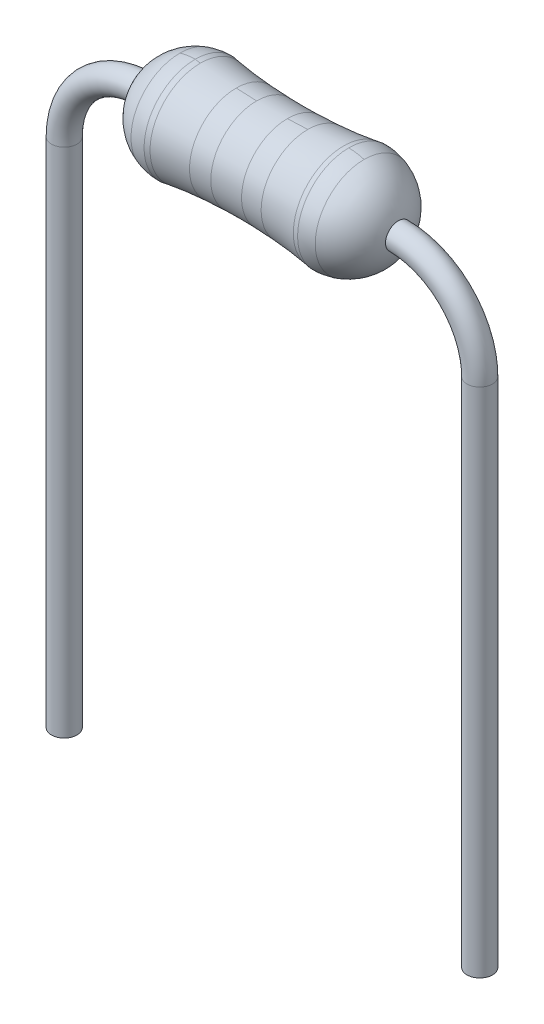
ISO-10303-21;
HEADER;
FILE_DESCRIPTION(('STEP AP214'),'2;1');
FILE_NAME('part.step','',(''),(''),'','','');
FILE_SCHEMA(('AUTOMOTIVE_DESIGN { 1 0 10303 214 1 1 1 1 }'));
ENDSEC;
DATA;
#1=APPLICATION_CONTEXT('core data for automotive mechanical design processes');
#2=APPLICATION_PROTOCOL_DEFINITION('international standard','automotive_design',2000,#1);
#3=PRODUCT_CONTEXT('',#1,'mechanical');
#4=PRODUCT('Part','Part','',(#3));
#5=PRODUCT_RELATED_PRODUCT_CATEGORY('part','',(#4));
#6=PRODUCT_DEFINITION_FORMATION('','',#4);
#7=PRODUCT_DEFINITION_CONTEXT('part definition',#1,'design');
#8=PRODUCT_DEFINITION('design','',#6,#7);
#9=PRODUCT_DEFINITION_SHAPE('','',#8);
#10=(LENGTH_UNIT() NAMED_UNIT(*) SI_UNIT(.MILLI.,.METRE.));
#11=(NAMED_UNIT(*) PLANE_ANGLE_UNIT() SI_UNIT($,.RADIAN.));
#12=(NAMED_UNIT(*) SI_UNIT($,.STERADIAN.) SOLID_ANGLE_UNIT());
#13=UNCERTAINTY_MEASURE_WITH_UNIT(LENGTH_MEASURE(1.E-05),#10,'distance_accuracy_value','');
#14=(GEOMETRIC_REPRESENTATION_CONTEXT(3) GLOBAL_UNCERTAINTY_ASSIGNED_CONTEXT((#13)) GLOBAL_UNIT_ASSIGNED_CONTEXT((#10,
#11,#12)) REPRESENTATION_CONTEXT('',''));
#15=CARTESIAN_POINT('',(0.,0.,0.));
#16=DIRECTION('',(0.,0.,1.));
#17=DIRECTION('',(1.,0.,0.));
#18=AXIS2_PLACEMENT_3D('',#15,#16,#17);
#19=CARTESIAN_POINT('',(-3.13467221242086,-2.02126777726707,0.));
#20=DIRECTION('',(0.,0.,-1.));
#21=DIRECTION('',(0.,1.,0.));
#22=AXIS2_PLACEMENT_3D('',#19,#20,#21);
#23=TOROIDAL_SURFACE('',#22,2.02126777726707,0.3175);
#24=CARTESIAN_POINT('',(-3.13467221242085,0.,0.));
#25=DIRECTION('',(-1.,0.,0.));
#26=DIRECTION('',(0.,0.,1.));
#27=AXIS2_PLACEMENT_3D('',#24,#25,#26);
#28=CIRCLE('',#27,0.3175);
#29=CARTESIAN_POINT('',(-3.13467221242085,0.,0.3175));
#30=VERTEX_POINT('',#29);
#31=EDGE_CURVE('E108',#30,#30,#28,.T.);
#32=ORIENTED_EDGE('',*,*,#31,.T.);
#33=EDGE_LOOP('',(#32));
#34=FACE_BOUND('',#33,.T.);
#35=CARTESIAN_POINT('',(-5.15593998968792,-2.02126777726707,0.));
#36=DIRECTION('',(0.,-1.,0.));
#37=DIRECTION('',(0.,0.,-1.));
#38=AXIS2_PLACEMENT_3D('',#35,#36,#37);
#39=CIRCLE('',#38,0.3175);
#40=CARTESIAN_POINT('',(-5.15593998968792,-2.02126777726707,-0.3175));
#41=VERTEX_POINT('',#40);
#42=EDGE_CURVE('E13',#41,#41,#39,.T.);
#43=ORIENTED_EDGE('',*,*,#42,.F.);
#44=EDGE_LOOP('',(#43));
#45=FACE_BOUND('',#44,.T.);
#46=ADVANCED_FACE('F100',(#34,#45),#23,.T.);
#47=CARTESIAN_POINT('',(-5.15593998968789,-14.7212677772671,0.));
#48=DIRECTION('',(0.,1.,0.));
#49=DIRECTION('',(0.,0.,1.));
#50=AXIS2_PLACEMENT_3D('',#47,#48,#49);
#51=CYLINDRICAL_SURFACE('',#50,0.3175);
#52=ORIENTED_EDGE('',*,*,#42,.T.);
#53=EDGE_LOOP('',(#52));
#54=FACE_BOUND('',#53,.T.);
#55=CARTESIAN_POINT('',(-5.15593998968789,-14.7212677772671,0.));
#56=DIRECTION('',(0.,-1.,0.));
#57=DIRECTION('',(0.,0.,1.));
#58=AXIS2_PLACEMENT_3D('',#55,#56,#57);
#59=CIRCLE('',#58,0.3175);
#60=CARTESIAN_POINT('',(-5.15593998968789,-14.7212677772671,0.3175));
#61=VERTEX_POINT('',#60);
#62=EDGE_CURVE('E113',#61,#61,#59,.T.);
#63=ORIENTED_EDGE('',*,*,#62,.F.);
#64=EDGE_LOOP('',(#63));
#65=FACE_BOUND('',#64,.T.);
#66=ADVANCED_FACE('F124',(#54,#65),#51,.T.);
#67=CARTESIAN_POINT('',(-5.15593998968789,-14.7212677772671,0.));
#68=DIRECTION('',(0.,1.,0.));
#69=DIRECTION('',(0.,0.,1.));
#70=AXIS2_PLACEMENT_3D('',#67,#68,#69);
#71=PLANE('',#70);
#72=ORIENTED_EDGE('',*,*,#62,.T.);
#73=EDGE_LOOP('',(#72));
#74=FACE_BOUND('',#73,.T.);
#75=ADVANCED_FACE('F122',(#74),#71,.F.);
#76=CARTESIAN_POINT('',(-3.13467221242085,0.,0.));
#77=DIRECTION('',(1.,0.,0.));
#78=DIRECTION('',(0.,0.,1.));
#79=AXIS2_PLACEMENT_3D('',#76,#77,#78);
#80=PLANE('',#79);
#81=ORIENTED_EDGE('',*,*,#31,.F.);
#82=EDGE_LOOP('',(#81));
#83=FACE_BOUND('',#82,.T.);
#84=ADVANCED_FACE('F102',(#83),#80,.T.);
#85=CLOSED_SHELL('',(#46,#66,#75,#84));
#86=MANIFOLD_SOLID_BREP('B2',#85);
#87=CARTESIAN_POINT('',(5.15593998968788,-14.7212677772671,0.));
#88=DIRECTION('',(0.,1.,0.));
#89=DIRECTION('',(0.,0.,1.));
#90=AXIS2_PLACEMENT_3D('',#87,#88,#89);
#91=CYLINDRICAL_SURFACE('',#90,0.3175);
#92=CARTESIAN_POINT('',(5.15593998968792,-2.02126777726707,0.));
#93=DIRECTION('',(0.,1.,0.));
#94=DIRECTION('',(0.,0.,-1.));
#95=AXIS2_PLACEMENT_3D('',#92,#93,#94);
#96=CIRCLE('',#95,0.3175);
#97=CARTESIAN_POINT('',(5.15593998968792,-2.02126777726707,-0.3175));
#98=VERTEX_POINT('',#97);
#99=EDGE_CURVE('E179',#98,#98,#96,.T.);
#100=ORIENTED_EDGE('',*,*,#99,.F.);
#101=EDGE_LOOP('',(#100));
#102=FACE_BOUND('',#101,.T.);
#103=CARTESIAN_POINT('',(5.15593998968788,-14.7212677772671,0.));
#104=DIRECTION('',(0.,1.,0.));
#105=DIRECTION('',(0.,0.,1.));
#106=AXIS2_PLACEMENT_3D('',#103,#104,#105);
#107=CIRCLE('',#106,0.3175);
#108=CARTESIAN_POINT('',(5.15593998968788,-14.7212677772671,0.3175));
#109=VERTEX_POINT('',#108);
#110=EDGE_CURVE('E99',#109,#109,#107,.T.);
#111=ORIENTED_EDGE('',*,*,#110,.T.);
#112=EDGE_LOOP('',(#111));
#113=FACE_BOUND('',#112,.T.);
#114=ADVANCED_FACE('F171',(#102,#113),#91,.T.);
#115=CARTESIAN_POINT('',(3.13467221242085,-2.02126777726707,0.));
#116=DIRECTION('',(0.,0.,-1.));
#117=DIRECTION('',(0.,1.,0.));
#118=AXIS2_PLACEMENT_3D('',#115,#116,#117);
#119=TOROIDAL_SURFACE('',#118,2.02126777726707,0.3175);
#120=CARTESIAN_POINT('',(3.13467221242085,0.,0.));
#121=DIRECTION('',(-1.,0.,0.));
#122=DIRECTION('',(0.,0.,1.));
#123=AXIS2_PLACEMENT_3D('',#120,#121,#122);
#124=CIRCLE('',#123,0.3175);
#125=CARTESIAN_POINT('',(3.13467221242085,0.,0.3175));
#126=VERTEX_POINT('',#125);
#127=EDGE_CURVE('E184',#126,#126,#124,.T.);
#128=ORIENTED_EDGE('',*,*,#127,.F.);
#129=EDGE_LOOP('',(#128));
#130=FACE_BOUND('',#129,.T.);
#131=ORIENTED_EDGE('',*,*,#99,.T.);
#132=EDGE_LOOP('',(#131));
#133=FACE_BOUND('',#132,.T.);
#134=ADVANCED_FACE('F194',(#130,#133),#119,.T.);
#135=CARTESIAN_POINT('',(5.15593998968788,-14.7212677772671,0.));
#136=DIRECTION('',(0.,1.,0.));
#137=DIRECTION('',(0.,0.,1.));
#138=AXIS2_PLACEMENT_3D('',#135,#136,#137);
#139=PLANE('',#138);
#140=ORIENTED_EDGE('',*,*,#110,.F.);
#141=EDGE_LOOP('',(#140));
#142=FACE_BOUND('',#141,.T.);
#143=ADVANCED_FACE('F197',(#142),#139,.F.);
#144=CARTESIAN_POINT('',(3.13467221242085,0.,0.));
#145=DIRECTION('',(-1.,0.,0.));
#146=DIRECTION('',(0.,0.,1.));
#147=AXIS2_PLACEMENT_3D('',#144,#145,#146);
#148=PLANE('',#147);
#149=ORIENTED_EDGE('',*,*,#127,.T.);
#150=EDGE_LOOP('',(#149));
#151=FACE_BOUND('',#150,.T.);
#152=ADVANCED_FACE('F173',(#151),#148,.T.);
#153=CLOSED_SHELL('',(#114,#134,#143,#152));
#154=MANIFOLD_SOLID_BREP('B8',#153);
#155=CARTESIAN_POINT('',(-1.905,1.27,0.));
#156=CARTESIAN_POINT('',(-0.862745128062082,1.08622234530251,0.));
#157=CARTESIAN_POINT('',(0.86274512806208,1.08622234530251,0.));
#158=CARTESIAN_POINT('',(1.905,1.27,0.));
#159=B_SPLINE_CURVE_WITH_KNOTS('',3,(#155,#156,#157,#158),.UNSPECIFIED.,.F.,.F.,(4,4),(0.,1.),.UNSPECIFIED.);
#160=CARTESIAN_POINT('',(-3.175,0.,0.));
#161=DIRECTION('',(-1.,0.,0.));
#162=AXIS1_PLACEMENT('',#160,#161);
#163=SURFACE_OF_REVOLUTION('',#159,#162);
#164=CARTESIAN_POINT('',(0.888999999999957,0.,0.));
#165=DIRECTION('',(-1.,0.,0.));
#166=DIRECTION('',(0.,-1.,0.));
#167=AXIS2_PLACEMENT_3D('',#164,#165,#166);
#168=CIRCLE('',#167,1.15825327904731);
#169=CARTESIAN_POINT('',(0.888999999999957,-1.15825327903251,0.));
#170=VERTEX_POINT('',#169);
#171=CARTESIAN_POINT('',(0.888999999999957,1.15825327904638,0.));
#172=VERTEX_POINT('',#171);
#173=EDGE_CURVE('E382',#170,#172,#168,.F.);
#174=ORIENTED_EDGE('',*,*,#173,.T.);
#175=EDGE_CURVE('E389',#172,#170,#168,.F.);
#176=ORIENTED_EDGE('',*,*,#175,.T.);
#177=EDGE_LOOP('',(#174,#176));
#178=FACE_BOUND('',#177,.T.);
#179=CARTESIAN_POINT('',(1.778,0.,0.));
#180=DIRECTION('',(-1.,0.,0.));
#181=DIRECTION('',(0.,-1.,0.));
#182=AXIS2_PLACEMENT_3D('',#179,#180,#181);
#183=CIRCLE('',#182,1.24902395068781);
#184=CARTESIAN_POINT('',(1.778,-1.24902395068781,0.));
#185=VERTEX_POINT('',#184);
#186=EDGE_CURVE('E169',#185,#185,#183,.T.);
#187=ORIENTED_EDGE('',*,*,#186,.T.);
#188=EDGE_LOOP('',(#187));
#189=FACE_BOUND('',#188,.T.);
#190=ADVANCED_FACE('F233',(#178,#189),#163,.F.);
#191=CARTESIAN_POINT('',(1.905,0.,0.));
#192=DIRECTION('',(0.,0.,1.));
#193=DIRECTION('',(1.,0.,0.));
#194=AXIS2_PLACEMENT_3D('',#191,#192,#193);
#195=SPHERICAL_SURFACE('',#194,1.27);
#196=CARTESIAN_POINT('',(2.286,0.,0.));
#197=DIRECTION('',(-1.,0.,0.));
#198=DIRECTION('',(0.,-1.,0.));
#199=AXIS2_PLACEMENT_3D('',#196,#197,#198);
#200=CIRCLE('',#199,1.21150278579952);
#201=CARTESIAN_POINT('',(2.286,-1.21150278579952,0.));
#202=VERTEX_POINT('',#201);
#203=CARTESIAN_POINT('',(2.286,1.21150278579952,0.));
#204=VERTEX_POINT('',#203);
#205=EDGE_CURVE('E254',#202,#204,#200,.F.);
#206=ORIENTED_EDGE('',*,*,#205,.F.);
#207=CARTESIAN_POINT('',(1.905,0.,0.));
#208=DIRECTION('',(0.,0.,-1.));
#209=DIRECTION('',(-1.,0.,0.));
#210=AXIS2_PLACEMENT_3D('',#207,#208,#209);
#211=CIRCLE('',#210,1.27);
#212=CARTESIAN_POINT('',(1.905,-1.27,0.));
#213=VERTEX_POINT('',#212);
#214=EDGE_CURVE('E242',#202,#213,#211,.T.);
#215=ORIENTED_EDGE('',*,*,#214,.T.);
#216=CARTESIAN_POINT('',(1.905,0.,0.));
#217=DIRECTION('',(-1.,0.,0.));
#218=DIRECTION('',(0.,-1.,0.));
#219=AXIS2_PLACEMENT_3D('',#216,#217,#218);
#220=CIRCLE('',#219,1.27);
#221=CARTESIAN_POINT('',(1.905,1.27,0.));
#222=VERTEX_POINT('',#221);
#223=EDGE_CURVE('E511',#222,#213,#220,.T.);
#224=ORIENTED_EDGE('',*,*,#223,.F.);
#225=CARTESIAN_POINT('',(1.905,0.,0.));
#226=DIRECTION('',(0.,0.,-1.));
#227=DIRECTION('',(-1.,0.,0.));
#228=AXIS2_PLACEMENT_3D('',#225,#226,#227);
#229=CIRCLE('',#228,1.27);
#230=EDGE_CURVE('E408',#222,#204,#229,.T.);
#231=ORIENTED_EDGE('',*,*,#230,.T.);
#232=EDGE_LOOP('',(#206,#215,#224,#231));
#233=FACE_BOUND('',#232,.T.);
#234=ADVANCED_FACE('F505',(#233),#195,.T.);
#235=CARTESIAN_POINT('',(1.905,0.,0.));
#236=DIRECTION('',(-1.,0.,0.));
#237=DIRECTION('',(0.,-1.,0.));
#238=AXIS2_PLACEMENT_3D('',#235,#236,#237);
#239=SPHERICAL_SURFACE('',#238,1.27);
#240=EDGE_CURVE('E415',#204,#202,#200,.F.);
#241=ORIENTED_EDGE('',*,*,#240,.T.);
#242=ORIENTED_EDGE('',*,*,#205,.T.);
#243=EDGE_LOOP('',(#241,#242));
#244=FACE_BOUND('',#243,.T.);
#245=ADVANCED_FACE('F514',(#244),#239,.T.);
#246=ORIENTED_EDGE('',*,*,#175,.F.);
#247=CARTESIAN_POINT('',(0.888999999999957,1.15825327904638,0.));
#248=CARTESIAN_POINT('',(0.723447487046332,1.14821999360356,0.));
#249=CARTESIAN_POINT('',(0.553213957441119,1.14108092756524,0.));
#250=CARTESIAN_POINT('',(0.381,1.13683608093141,0.));
#251=B_SPLINE_CURVE_WITH_KNOTS('',3,(#247,#248,#249,#250),.UNSPECIFIED.,.F.,.F.,(4,4),
(0.282479048496141,0.407972011356775),.UNSPECIFIED.);
#252=CARTESIAN_POINT('',(0.381,1.13683608093141,0.));
#253=VERTEX_POINT('',#252);
#254=EDGE_CURVE('E403',#172,#253,#251,.T.);
#255=ORIENTED_EDGE('',*,*,#254,.T.);
#256=CARTESIAN_POINT('',(0.381,0.,0.));
#257=DIRECTION('',(-1.,0.,0.));
#258=DIRECTION('',(0.,-1.,0.));
#259=AXIS2_PLACEMENT_3D('',#256,#257,#258);
#260=CIRCLE('',#259,1.13683608093219);
#261=CARTESIAN_POINT('',(0.381,-1.13683608092682,0.));
#262=VERTEX_POINT('',#261);
#263=EDGE_CURVE('E395',#262,#253,#260,.T.);
#264=ORIENTED_EDGE('',*,*,#263,.F.);
#265=CARTESIAN_POINT('',(0.381,-1.13683608092682,0.));
#266=CARTESIAN_POINT('',(0.553213957440822,-1.14108092755752,0.));
#267=CARTESIAN_POINT('',(0.723447487045802,-1.14821999359273,0.));
#268=CARTESIAN_POINT('',(0.888999999999274,-1.15825327903251,0.));
#269=B_SPLINE_CURVE_WITH_KNOTS('',3,(#265,#266,#267,#268),.UNSPECIFIED.,.F.,.F.,(4,4),
(0.592027988643127,0.717520951503487),.UNSPECIFIED.);
#270=EDGE_CURVE('E390',#262,#170,#269,.T.);
#271=ORIENTED_EDGE('',*,*,#270,.T.);
#272=EDGE_LOOP('',(#246,#255,#264,#271));
#273=FACE_BOUND('',#272,.T.);
#274=ADVANCED_FACE('F494',(#273),#163,.F.);
#275=CARTESIAN_POINT('',(-0.381,0.,0.));
#276=DIRECTION('',(-1.,0.,0.));
#277=DIRECTION('',(0.,-1.,0.));
#278=AXIS2_PLACEMENT_3D('',#275,#276,#277);
#279=CIRCLE('',#278,1.13683608093219);
#280=CARTESIAN_POINT('',(-0.381,-1.13683608092679,0.));
#281=VERTEX_POINT('',#280);
#282=CARTESIAN_POINT('',(-0.381,1.13683608093141,0.));
#283=VERTEX_POINT('',#282);
#284=EDGE_CURVE('E369',#281,#283,#279,.F.);
#285=ORIENTED_EDGE('',*,*,#284,.T.);
#286=EDGE_CURVE('E376',#283,#281,#279,.F.);
#287=ORIENTED_EDGE('',*,*,#286,.T.);
#288=EDGE_LOOP('',(#285,#287));
#289=FACE_BOUND('',#288,.T.);
#290=ORIENTED_EDGE('',*,*,#263,.T.);
#291=EDGE_CURVE('E402',#253,#262,#260,.T.);
#292=ORIENTED_EDGE('',*,*,#291,.T.);
#293=EDGE_LOOP('',(#290,#292));
#294=FACE_BOUND('',#293,.T.);
#295=ADVANCED_FACE('F490',(#289,#294),#163,.F.);
#296=ORIENTED_EDGE('',*,*,#186,.F.);
#297=EDGE_LOOP('',(#296));
#298=FACE_BOUND('',#297,.T.);
#299=EDGE_CURVE('E335',#213,#222,#220,.T.);
#300=ORIENTED_EDGE('',*,*,#299,.T.);
#301=ORIENTED_EDGE('',*,*,#223,.T.);
#302=EDGE_LOOP('',(#300,#301));
#303=FACE_BOUND('',#302,.T.);
#304=ADVANCED_FACE('F493',(#298,#303),#163,.F.);
#305=CARTESIAN_POINT('',(-0.889000000000015,0.,0.));
#306=DIRECTION('',(-1.,0.,0.));
#307=DIRECTION('',(0.,-1.,0.));
#308=AXIS2_PLACEMENT_3D('',#305,#306,#307);
#309=CIRCLE('',#308,1.15825327904731);
#310=CARTESIAN_POINT('',(-0.889000000000015,-1.15825327903251,0.));
#311=VERTEX_POINT('',#310);
#312=CARTESIAN_POINT('',(-0.889000000000015,1.15825327904638,0.));
#313=VERTEX_POINT('',#312);
#314=EDGE_CURVE('E350',#311,#313,#309,.T.);
#315=ORIENTED_EDGE('',*,*,#314,.F.);
#316=CARTESIAN_POINT('',(-0.889,-1.15825327903251,0.));
#317=CARTESIAN_POINT('',(-0.723447487046307,-1.14821999359271,0.));
#318=CARTESIAN_POINT('',(-0.553213957441082,-1.14108092755749,0.));
#319=CARTESIAN_POINT('',(-0.381,-1.13683608092679,0.));
#320=B_SPLINE_CURVE_WITH_KNOTS('',3,(#316,#317,#318,#319),.UNSPECIFIED.,.F.,.F.,(4,4),
(0.282479048495963,0.40797201135652),.UNSPECIFIED.);
#321=EDGE_CURVE('E377',#311,#281,#320,.T.);
#322=ORIENTED_EDGE('',*,*,#321,.T.);
#323=ORIENTED_EDGE('',*,*,#286,.F.);
#324=CARTESIAN_POINT('',(-0.381,1.13683608093141,0.));
#325=CARTESIAN_POINT('',(-0.553213957441135,1.14108092756524,0.));
#326=CARTESIAN_POINT('',(-0.723447487046363,1.14821999360356,0.));
#327=CARTESIAN_POINT('',(-0.889,1.15825327904638,0.));
#328=B_SPLINE_CURVE_WITH_KNOTS('',3,(#324,#325,#326,#327),.UNSPECIFIED.,.F.,.F.,(4,4),
(0.592027988643268,0.717520951503915),.UNSPECIFIED.);
#329=EDGE_CURVE('E364',#283,#313,#328,.T.);
#330=ORIENTED_EDGE('',*,*,#329,.T.);
#331=EDGE_LOOP('',(#315,#322,#323,#330));
#332=FACE_BOUND('',#331,.T.);
#333=ADVANCED_FACE('F484',(#332),#163,.F.);
#334=ORIENTED_EDGE('',*,*,#254,.F.);
#335=ORIENTED_EDGE('',*,*,#173,.F.);
#336=ORIENTED_EDGE('',*,*,#270,.F.);
#337=ORIENTED_EDGE('',*,*,#291,.F.);
#338=EDGE_LOOP('',(#334,#335,#336,#337));
#339=FACE_BOUND('',#338,.T.);
#340=ADVANCED_FACE('F479',(#339),#163,.F.);
#341=CARTESIAN_POINT('',(-1.778,0.,0.));
#342=DIRECTION('',(-1.,0.,0.));
#343=DIRECTION('',(0.,-1.,0.));
#344=AXIS2_PLACEMENT_3D('',#341,#342,#343);
#345=CIRCLE('',#344,1.24902395068781);
#346=CARTESIAN_POINT('',(-1.778,-1.24902395068473,0.));
#347=VERTEX_POINT('',#346);
#348=CARTESIAN_POINT('',(-1.778,1.24902395077805,0.));
#349=VERTEX_POINT('',#348);
#350=EDGE_CURVE('E311',#347,#349,#345,.F.);
#351=ORIENTED_EDGE('',*,*,#350,.T.);
#352=EDGE_CURVE('E318',#349,#347,#345,.F.);
#353=ORIENTED_EDGE('',*,*,#352,.T.);
#354=EDGE_LOOP('',(#351,#353));
#355=FACE_BOUND('',#354,.T.);
#356=ORIENTED_EDGE('',*,*,#314,.T.);
#357=EDGE_CURVE('E363',#313,#311,#309,.T.);
#358=ORIENTED_EDGE('',*,*,#357,.T.);
#359=EDGE_LOOP('',(#356,#358));
#360=FACE_BOUND('',#359,.T.);
#361=ADVANCED_FACE('F476',(#355,#360),#163,.F.);
#362=ORIENTED_EDGE('',*,*,#352,.F.);
#363=CARTESIAN_POINT('',(-1.778,1.24902395077805,0.));
#364=CARTESIAN_POINT('',(-1.82134895448028,1.25572754952758,0.));
#365=CARTESIAN_POINT('',(-1.86371060648022,1.26271956593487,0.));
#366=CARTESIAN_POINT('',(-1.905,1.27,0.));
#367=B_SPLINE_CURVE_WITH_KNOTS('',3,(#363,#364,#365,#366),.UNSPECIFIED.,.F.,.F.,(4,4),
(0.96038455216048,1.),.UNSPECIFIED.);
#368=CARTESIAN_POINT('',(-1.905,1.27,0.));
#369=VERTEX_POINT('',#368);
#370=EDGE_CURVE('E317',#349,#369,#367,.T.);
#371=ORIENTED_EDGE('',*,*,#370,.T.);
#372=CARTESIAN_POINT('',(-1.905,0.,0.));
#373=DIRECTION('',(-1.,0.,0.));
#374=DIRECTION('',(0.,-1.,0.));
#375=AXIS2_PLACEMENT_3D('',#372,#373,#374);
#376=CIRCLE('',#375,1.27);
#377=CARTESIAN_POINT('',(-1.905,-1.27,0.));
#378=VERTEX_POINT('',#377);
#379=EDGE_CURVE('E323',#378,#369,#376,.T.);
#380=ORIENTED_EDGE('',*,*,#379,.F.);
#381=CARTESIAN_POINT('',(-1.905,-1.27,0.));
#382=CARTESIAN_POINT('',(-1.86371060648066,-1.26271956590445,0.));
#383=CARTESIAN_POINT('',(-1.82134895448072,-1.25572754946602,0.));
#384=CARTESIAN_POINT('',(-1.778,-1.24902395068473,0.));
#385=B_SPLINE_CURVE_WITH_KNOTS('',3,(#381,#382,#383,#384),.UNSPECIFIED.,.F.,.F.,(4,4),(0.,
0.0396154478440981),.UNSPECIFIED.);
#386=EDGE_CURVE('E304',#378,#347,#385,.T.);
#387=ORIENTED_EDGE('',*,*,#386,.T.);
#388=EDGE_LOOP('',(#362,#371,#380,#387));
#389=FACE_BOUND('',#388,.T.);
#390=ADVANCED_FACE('F337',(#389),#163,.F.);
#391=ORIENTED_EDGE('',*,*,#321,.F.);
#392=ORIENTED_EDGE('',*,*,#357,.F.);
#393=ORIENTED_EDGE('',*,*,#329,.F.);
#394=ORIENTED_EDGE('',*,*,#284,.F.);
#395=EDGE_LOOP('',(#391,#392,#393,#394));
#396=FACE_BOUND('',#395,.T.);
#397=ADVANCED_FACE('F488',(#396),#163,.F.);
#398=CARTESIAN_POINT('',(-1.905,0.,0.));
#399=DIRECTION('',(0.,0.,1.));
#400=DIRECTION('',(1.,0.,0.));
#401=AXIS2_PLACEMENT_3D('',#398,#399,#400);
#402=SPHERICAL_SURFACE('',#401,1.27);
#403=CARTESIAN_POINT('',(-1.905,0.,0.));
#404=DIRECTION('',(0.,0.,-1.));
#405=DIRECTION('',(-1.,0.,0.));
#406=AXIS2_PLACEMENT_3D('',#403,#404,#405);
#407=CIRCLE('',#406,1.27);
#408=CARTESIAN_POINT('',(-2.286,1.21150278579952,0.));
#409=VERTEX_POINT('',#408);
#410=EDGE_CURVE('E334',#369,#409,#407,.F.);
#411=ORIENTED_EDGE('',*,*,#410,.F.);
#412=EDGE_CURVE('E308',#369,#378,#376,.T.);
#413=ORIENTED_EDGE('',*,*,#412,.T.);
#414=CARTESIAN_POINT('',(-1.905,0.,0.));
#415=DIRECTION('',(0.,0.,-1.));
#416=DIRECTION('',(-1.,0.,0.));
#417=AXIS2_PLACEMENT_3D('',#414,#415,#416);
#418=CIRCLE('',#417,1.27);
#419=CARTESIAN_POINT('',(-2.286,-1.21150278579952,0.));
#420=VERTEX_POINT('',#419);
#421=EDGE_CURVE('E322',#420,#378,#418,.F.);
#422=ORIENTED_EDGE('',*,*,#421,.F.);
#423=CARTESIAN_POINT('',(-2.286,0.,0.));
#424=DIRECTION('',(1.,0.,0.));
#425=DIRECTION('',(0.,0.,-1.));
#426=AXIS2_PLACEMENT_3D('',#423,#424,#425);
#427=CIRCLE('',#426,1.21150278579952);
#428=EDGE_CURVE('E330',#420,#409,#427,.T.);
#429=ORIENTED_EDGE('',*,*,#428,.T.);
#430=EDGE_LOOP('',(#411,#413,#422,#429));
#431=FACE_BOUND('',#430,.T.);
#432=ADVANCED_FACE('F333',(#431),#402,.T.);
#433=CARTESIAN_POINT('',(-1.905,0.,0.));
#434=DIRECTION('',(1.,0.,0.));
#435=DIRECTION('',(0.,0.,-1.));
#436=AXIS2_PLACEMENT_3D('',#433,#434,#435);
#437=SPHERICAL_SURFACE('',#436,1.27);
#438=EDGE_CURVE('E325',#409,#420,#427,.T.);
#439=ORIENTED_EDGE('',*,*,#438,.F.);
#440=ORIENTED_EDGE('',*,*,#428,.F.);
#441=EDGE_LOOP('',(#439,#440));
#442=FACE_BOUND('',#441,.T.);
#443=ADVANCED_FACE('F519',(#442),#437,.T.);
#444=ORIENTED_EDGE('',*,*,#214,.F.);
#445=ORIENTED_EDGE('',*,*,#240,.F.);
#446=ORIENTED_EDGE('',*,*,#230,.F.);
#447=ORIENTED_EDGE('',*,*,#299,.F.);
#448=EDGE_LOOP('',(#444,#445,#446,#447));
#449=FACE_BOUND('',#448,.T.);
#450=ADVANCED_FACE('F512',(#449),#195,.T.);
#451=ORIENTED_EDGE('',*,*,#370,.F.);
#452=ORIENTED_EDGE('',*,*,#350,.F.);
#453=ORIENTED_EDGE('',*,*,#386,.F.);
#454=ORIENTED_EDGE('',*,*,#412,.F.);
#455=EDGE_LOOP('',(#451,#452,#453,#454));
#456=FACE_BOUND('',#455,.T.);
#457=ADVANCED_FACE('F306',(#456),#163,.F.);
#458=ORIENTED_EDGE('',*,*,#379,.T.);
#459=ORIENTED_EDGE('',*,*,#410,.T.);
#460=ORIENTED_EDGE('',*,*,#438,.T.);
#461=ORIENTED_EDGE('',*,*,#421,.T.);
#462=EDGE_LOOP('',(#458,#459,#460,#461));
#463=FACE_BOUND('',#462,.T.);
#464=ADVANCED_FACE('F235',(#463),#402,.T.);
#465=CLOSED_SHELL('',(#190,#234,#245,#274,#295,#304,#333,#340,#361,#390,#397,#432,#443,#450,
#457,#464));
#466=MANIFOLD_SOLID_BREP('B94',#465);
#467=ADVANCED_BREP_SHAPE_REPRESENTATION('',(#18,#86,#154,#466),#14);
#468=SHAPE_DEFINITION_REPRESENTATION(#9,#467);
ENDSEC;
END-ISO-10303-21;
